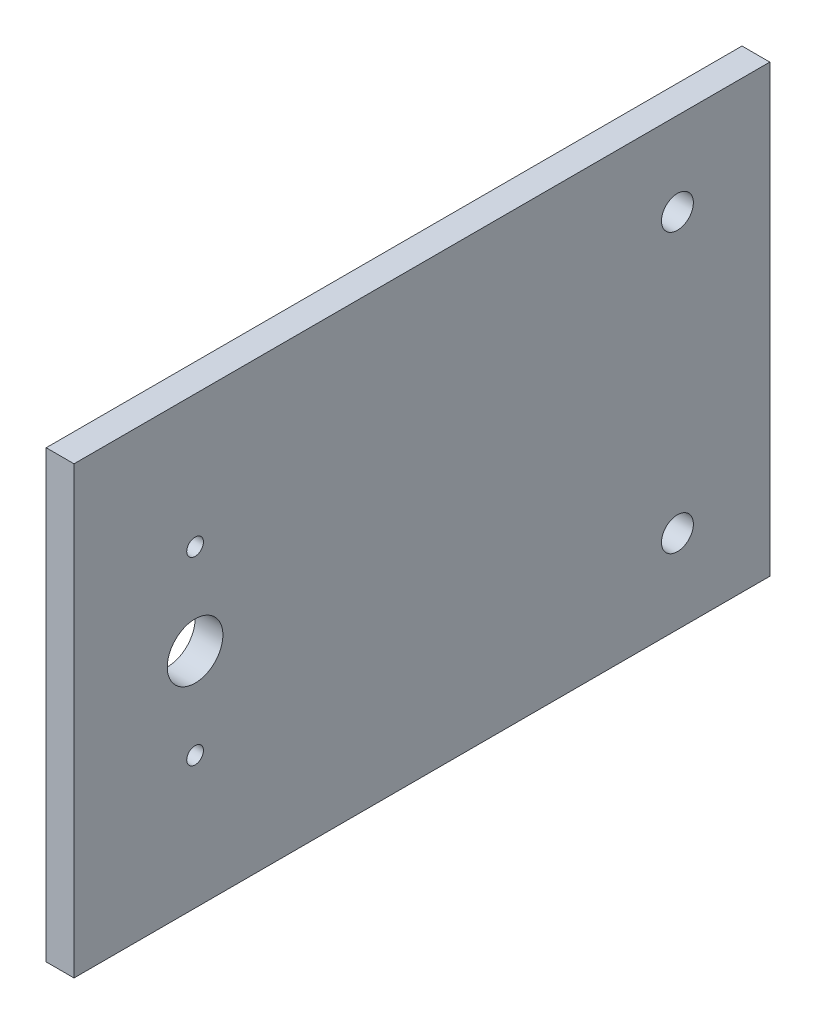
ISO-10303-21;
HEADER;
FILE_DESCRIPTION(('STEP AP214'),'2;1');
FILE_NAME('part.step','',(''),(''),'','','');
FILE_SCHEMA(('AUTOMOTIVE_DESIGN { 1 0 10303 214 1 1 1 1 }'));
ENDSEC;
DATA;
#1=APPLICATION_CONTEXT('core data for automotive mechanical design processes');
#2=APPLICATION_PROTOCOL_DEFINITION('international standard','automotive_design',2000,#1);
#3=PRODUCT_CONTEXT('',#1,'mechanical');
#4=PRODUCT('Part','Part','',(#3));
#5=PRODUCT_RELATED_PRODUCT_CATEGORY('part','',(#4));
#6=PRODUCT_DEFINITION_FORMATION('','',#4);
#7=PRODUCT_DEFINITION_CONTEXT('part definition',#1,'design');
#8=PRODUCT_DEFINITION('design','',#6,#7);
#9=PRODUCT_DEFINITION_SHAPE('','',#8);
#10=(LENGTH_UNIT() NAMED_UNIT(*) SI_UNIT(.MILLI.,.METRE.));
#11=(NAMED_UNIT(*) PLANE_ANGLE_UNIT() SI_UNIT($,.RADIAN.));
#12=(NAMED_UNIT(*) SI_UNIT($,.STERADIAN.) SOLID_ANGLE_UNIT());
#13=UNCERTAINTY_MEASURE_WITH_UNIT(LENGTH_MEASURE(1.E-05),#10,'distance_accuracy_value','');
#14=(GEOMETRIC_REPRESENTATION_CONTEXT(3) GLOBAL_UNCERTAINTY_ASSIGNED_CONTEXT((#13)) GLOBAL_UNIT_ASSIGNED_CONTEXT((#10,
#11,#12)) REPRESENTATION_CONTEXT('',''));
#15=CARTESIAN_POINT('',(0.,0.,0.));
#16=DIRECTION('',(0.,0.,1.));
#17=DIRECTION('',(1.,0.,0.));
#18=AXIS2_PLACEMENT_3D('',#15,#16,#17);
#19=CARTESIAN_POINT('',(5.,0.,0.));
#20=DIRECTION('',(-1.,0.,0.));
#21=DIRECTION('',(0.,0.,1.));
#22=AXIS2_PLACEMENT_3D('',#19,#20,#21);
#23=PLANE('',#22);
#24=DIRECTION('',(0.,0.,1.));
#25=VECTOR('',#24,1.);
#26=CARTESIAN_POINT('',(5.,40.,-62.5));
#27=LINE('',#26,#25);
#28=CARTESIAN_POINT('',(5.,40.,-62.5));
#29=VERTEX_POINT('',#28);
#30=CARTESIAN_POINT('',(5.,40.,62.5));
#31=VERTEX_POINT('',#30);
#32=EDGE_CURVE('E98',#29,#31,#27,.T.);
#33=ORIENTED_EDGE('',*,*,#32,.T.);
#34=DIRECTION('',(0.,-1.,0.));
#35=VECTOR('',#34,1.);
#36=CARTESIAN_POINT('',(5.,-40.,62.5));
#37=LINE('',#36,#35);
#38=CARTESIAN_POINT('',(5.,-40.,62.5));
#39=VERTEX_POINT('',#38);
#40=EDGE_CURVE('E93',#31,#39,#37,.T.);
#41=ORIENTED_EDGE('',*,*,#40,.T.);
#42=DIRECTION('',(0.,0.,-1.));
#43=VECTOR('',#42,1.);
#44=CARTESIAN_POINT('',(5.,-40.,-62.5));
#45=LINE('',#44,#43);
#46=CARTESIAN_POINT('',(5.,-40.,-62.5));
#47=VERTEX_POINT('',#46);
#48=EDGE_CURVE('E96',#39,#47,#45,.T.);
#49=ORIENTED_EDGE('',*,*,#48,.T.);
#50=DIRECTION('',(0.,1.,0.));
#51=VECTOR('',#50,1.);
#52=CARTESIAN_POINT('',(5.,-40.,-62.5));
#53=LINE('',#52,#51);
#54=EDGE_CURVE('E63',#47,#29,#53,.T.);
#55=ORIENTED_EDGE('',*,*,#54,.T.);
#56=EDGE_LOOP('',(#33,#41,#49,#55));
#57=FACE_BOUND('',#56,.T.);
#58=CARTESIAN_POINT('',(5.,-16.22,40.75));
#59=DIRECTION('',(1.,0.,0.));
#60=DIRECTION('',(0.,0.,-1.));
#61=AXIS2_PLACEMENT_3D('',#58,#59,#60);
#62=CIRCLE('',#61,1.5);
#63=CARTESIAN_POINT('',(5.,-16.22,39.25));
#64=VERTEX_POINT('',#63);
#65=EDGE_CURVE('E118',#64,#64,#62,.T.);
#66=ORIENTED_EDGE('',*,*,#65,.F.);
#67=EDGE_LOOP('',(#66));
#68=FACE_BOUND('',#67,.T.);
#69=CARTESIAN_POINT('',(5.,16.22,40.75));
#70=DIRECTION('',(1.,0.,0.));
#71=DIRECTION('',(0.,0.,1.));
#72=AXIS2_PLACEMENT_3D('',#69,#70,#71);
#73=CIRCLE('',#72,1.5);
#74=CARTESIAN_POINT('',(5.,16.22,42.25));
#75=VERTEX_POINT('',#74);
#76=EDGE_CURVE('E140',#75,#75,#73,.T.);
#77=ORIENTED_EDGE('',*,*,#76,.F.);
#78=EDGE_LOOP('',(#77));
#79=FACE_BOUND('',#78,.T.);
#80=CARTESIAN_POINT('',(5.,-25.,-45.9));
#81=DIRECTION('',(1.,0.,0.));
#82=DIRECTION('',(0.,0.,-1.));
#83=AXIS2_PLACEMENT_3D('',#80,#81,#82);
#84=CIRCLE('',#83,2.8668225219106);
#85=CARTESIAN_POINT('',(5.,-25.,-48.7668225219106));
#86=VERTEX_POINT('',#85);
#87=EDGE_CURVE('E148',#86,#86,#84,.T.);
#88=ORIENTED_EDGE('',*,*,#87,.F.);
#89=EDGE_LOOP('',(#88));
#90=FACE_BOUND('',#89,.T.);
#91=CARTESIAN_POINT('',(5.,0.,40.75));
#92=DIRECTION('',(1.,0.,0.));
#93=DIRECTION('',(0.,0.,-1.));
#94=AXIS2_PLACEMENT_3D('',#91,#92,#93);
#95=CIRCLE('',#94,5.);
#96=CARTESIAN_POINT('',(5.,0.,35.75));
#97=VERTEX_POINT('',#96);
#98=EDGE_CURVE('E156',#97,#97,#95,.T.);
#99=ORIENTED_EDGE('',*,*,#98,.F.);
#100=EDGE_LOOP('',(#99));
#101=FACE_BOUND('',#100,.T.);
#102=CARTESIAN_POINT('',(5.,25.,-45.9));
#103=DIRECTION('',(1.,0.,0.));
#104=DIRECTION('',(0.,0.,1.));
#105=AXIS2_PLACEMENT_3D('',#102,#103,#104);
#106=CIRCLE('',#105,2.8668225219106);
#107=CARTESIAN_POINT('',(5.,25.,-43.0331774780894));
#108=VERTEX_POINT('',#107);
#109=EDGE_CURVE('E164',#108,#108,#106,.T.);
#110=ORIENTED_EDGE('',*,*,#109,.F.);
#111=EDGE_LOOP('',(#110));
#112=FACE_BOUND('',#111,.T.);
#113=ADVANCED_FACE('F45',(#57,#68,#79,#90,#101,#112),#23,.F.);
#114=CARTESIAN_POINT('',(0.,0.,0.));
#115=DIRECTION('',(-1.,0.,0.));
#116=DIRECTION('',(0.,0.,1.));
#117=AXIS2_PLACEMENT_3D('',#114,#115,#116);
#118=PLANE('',#117);
#119=CARTESIAN_POINT('',(0.,0.,40.75));
#120=DIRECTION('',(1.,0.,0.));
#121=DIRECTION('',(0.,0.,-1.));
#122=AXIS2_PLACEMENT_3D('',#119,#120,#121);
#123=CIRCLE('',#122,5.);
#124=CARTESIAN_POINT('',(0.,0.,35.75));
#125=VERTEX_POINT('',#124);
#126=EDGE_CURVE('E160',#125,#125,#123,.T.);
#127=ORIENTED_EDGE('',*,*,#126,.T.);
#128=EDGE_LOOP('',(#127));
#129=FACE_BOUND('',#128,.T.);
#130=CARTESIAN_POINT('',(0.,16.22,40.75));
#131=DIRECTION('',(1.,0.,0.));
#132=DIRECTION('',(0.,0.,1.));
#133=AXIS2_PLACEMENT_3D('',#130,#131,#132);
#134=CIRCLE('',#133,1.5);
#135=CARTESIAN_POINT('',(0.,16.22,42.25));
#136=VERTEX_POINT('',#135);
#137=EDGE_CURVE('E144',#136,#136,#134,.T.);
#138=ORIENTED_EDGE('',*,*,#137,.T.);
#139=EDGE_LOOP('',(#138));
#140=FACE_BOUND('',#139,.T.);
#141=DIRECTION('',(0.,0.,1.));
#142=VECTOR('',#141,1.);
#143=CARTESIAN_POINT('',(0.,40.,-62.5));
#144=LINE('',#143,#142);
#145=CARTESIAN_POINT('',(0.,40.,-62.5));
#146=VERTEX_POINT('',#145);
#147=CARTESIAN_POINT('',(0.,40.,62.5));
#148=VERTEX_POINT('',#147);
#149=EDGE_CURVE('E114',#146,#148,#144,.T.);
#150=ORIENTED_EDGE('',*,*,#149,.F.);
#151=DIRECTION('',(0.,1.,0.));
#152=VECTOR('',#151,1.);
#153=CARTESIAN_POINT('',(0.,-40.,-62.5));
#154=LINE('',#153,#152);
#155=CARTESIAN_POINT('',(0.,-40.,-62.5));
#156=VERTEX_POINT('',#155);
#157=EDGE_CURVE('E86',#156,#146,#154,.T.);
#158=ORIENTED_EDGE('',*,*,#157,.F.);
#159=DIRECTION('',(0.,0.,-1.));
#160=VECTOR('',#159,1.);
#161=CARTESIAN_POINT('',(0.,-40.,-62.5));
#162=LINE('',#161,#160);
#163=CARTESIAN_POINT('',(0.,-40.,62.5));
#164=VERTEX_POINT('',#163);
#165=EDGE_CURVE('E80',#164,#156,#162,.T.);
#166=ORIENTED_EDGE('',*,*,#165,.F.);
#167=DIRECTION('',(0.,-1.,0.));
#168=VECTOR('',#167,1.);
#169=CARTESIAN_POINT('',(0.,-40.,62.5));
#170=LINE('',#169,#168);
#171=EDGE_CURVE('E103',#148,#164,#170,.T.);
#172=ORIENTED_EDGE('',*,*,#171,.F.);
#173=EDGE_LOOP('',(#150,#158,#166,#172));
#174=FACE_BOUND('',#173,.T.);
#175=CARTESIAN_POINT('',(0.,-16.22,40.75));
#176=DIRECTION('',(1.,0.,0.));
#177=DIRECTION('',(0.,0.,-1.));
#178=AXIS2_PLACEMENT_3D('',#175,#176,#177);
#179=CIRCLE('',#178,1.5);
#180=CARTESIAN_POINT('',(0.,-16.22,39.25));
#181=VERTEX_POINT('',#180);
#182=EDGE_CURVE('E136',#181,#181,#179,.T.);
#183=ORIENTED_EDGE('',*,*,#182,.T.);
#184=EDGE_LOOP('',(#183));
#185=FACE_BOUND('',#184,.T.);
#186=CARTESIAN_POINT('',(0.,-25.,-45.9));
#187=DIRECTION('',(1.,0.,0.));
#188=DIRECTION('',(0.,0.,-1.));
#189=AXIS2_PLACEMENT_3D('',#186,#187,#188);
#190=CIRCLE('',#189,2.8668225219106);
#191=CARTESIAN_POINT('',(0.,-25.,-48.7668225219106));
#192=VERTEX_POINT('',#191);
#193=EDGE_CURVE('E152',#192,#192,#190,.T.);
#194=ORIENTED_EDGE('',*,*,#193,.T.);
#195=EDGE_LOOP('',(#194));
#196=FACE_BOUND('',#195,.T.);
#197=CARTESIAN_POINT('',(0.,25.,-45.9));
#198=DIRECTION('',(1.,0.,0.));
#199=DIRECTION('',(0.,0.,1.));
#200=AXIS2_PLACEMENT_3D('',#197,#198,#199);
#201=CIRCLE('',#200,2.8668225219106);
#202=CARTESIAN_POINT('',(0.,25.,-43.0331774780894));
#203=VERTEX_POINT('',#202);
#204=EDGE_CURVE('E168',#203,#203,#201,.T.);
#205=ORIENTED_EDGE('',*,*,#204,.T.);
#206=EDGE_LOOP('',(#205));
#207=FACE_BOUND('',#206,.T.);
#208=ADVANCED_FACE('F131',(#129,#140,#174,#185,#196,#207),#118,.T.);
#209=CARTESIAN_POINT('',(5.,40.,-62.5));
#210=DIRECTION('',(0.,-1.,0.));
#211=DIRECTION('',(0.,0.,-1.));
#212=AXIS2_PLACEMENT_3D('',#209,#210,#211);
#213=PLANE('',#212);
#214=ORIENTED_EDGE('',*,*,#149,.T.);
#215=DIRECTION('',(-1.,0.,0.));
#216=VECTOR('',#215,1.);
#217=CARTESIAN_POINT('',(5.,40.,62.5));
#218=LINE('',#217,#216);
#219=EDGE_CURVE('E11',#31,#148,#218,.T.);
#220=ORIENTED_EDGE('',*,*,#219,.F.);
#221=ORIENTED_EDGE('',*,*,#32,.F.);
#222=DIRECTION('',(-1.,0.,0.));
#223=VECTOR('',#222,1.);
#224=CARTESIAN_POINT('',(5.,40.,-62.5));
#225=LINE('',#224,#223);
#226=EDGE_CURVE('E110',#29,#146,#225,.T.);
#227=ORIENTED_EDGE('',*,*,#226,.T.);
#228=EDGE_LOOP('',(#214,#220,#221,#227));
#229=FACE_BOUND('',#228,.T.);
#230=ADVANCED_FACE('F47',(#229),#213,.F.);
#231=CARTESIAN_POINT('',(5.,-40.,62.5));
#232=DIRECTION('',(0.,0.,-1.));
#233=DIRECTION('',(0.,1.,0.));
#234=AXIS2_PLACEMENT_3D('',#231,#232,#233);
#235=PLANE('',#234);
#236=ORIENTED_EDGE('',*,*,#171,.T.);
#237=DIRECTION('',(-1.,0.,0.));
#238=VECTOR('',#237,1.);
#239=CARTESIAN_POINT('',(5.,-40.,62.5));
#240=LINE('',#239,#238);
#241=EDGE_CURVE('E55',#39,#164,#240,.T.);
#242=ORIENTED_EDGE('',*,*,#241,.F.);
#243=ORIENTED_EDGE('',*,*,#40,.F.);
#244=ORIENTED_EDGE('',*,*,#219,.T.);
#245=EDGE_LOOP('',(#236,#242,#243,#244));
#246=FACE_BOUND('',#245,.T.);
#247=ADVANCED_FACE('F102',(#246),#235,.F.);
#248=CARTESIAN_POINT('',(5.,-40.,-62.5));
#249=DIRECTION('',(0.,1.,0.));
#250=DIRECTION('',(0.,0.,1.));
#251=AXIS2_PLACEMENT_3D('',#248,#249,#250);
#252=PLANE('',#251);
#253=ORIENTED_EDGE('',*,*,#165,.T.);
#254=DIRECTION('',(-1.,0.,0.));
#255=VECTOR('',#254,1.);
#256=CARTESIAN_POINT('',(5.,-40.,-62.5));
#257=LINE('',#256,#255);
#258=EDGE_CURVE('E105',#47,#156,#257,.T.);
#259=ORIENTED_EDGE('',*,*,#258,.F.);
#260=ORIENTED_EDGE('',*,*,#48,.F.);
#261=ORIENTED_EDGE('',*,*,#241,.T.);
#262=EDGE_LOOP('',(#253,#259,#260,#261));
#263=FACE_BOUND('',#262,.T.);
#264=ADVANCED_FACE('F106',(#263),#252,.F.);
#265=CARTESIAN_POINT('',(5.,-40.,-62.5));
#266=DIRECTION('',(0.,0.,1.));
#267=DIRECTION('',(0.,-1.,0.));
#268=AXIS2_PLACEMENT_3D('',#265,#266,#267);
#269=PLANE('',#268);
#270=ORIENTED_EDGE('',*,*,#157,.T.);
#271=ORIENTED_EDGE('',*,*,#226,.F.);
#272=ORIENTED_EDGE('',*,*,#54,.F.);
#273=ORIENTED_EDGE('',*,*,#258,.T.);
#274=EDGE_LOOP('',(#270,#271,#272,#273));
#275=FACE_BOUND('',#274,.T.);
#276=ADVANCED_FACE('F128',(#275),#269,.F.);
#277=CARTESIAN_POINT('',(5.,-16.22,40.75));
#278=DIRECTION('',(-1.,0.,0.));
#279=DIRECTION('',(0.,0.,1.));
#280=AXIS2_PLACEMENT_3D('',#277,#278,#279);
#281=CYLINDRICAL_SURFACE('',#280,1.5);
#282=ORIENTED_EDGE('',*,*,#65,.T.);
#283=EDGE_LOOP('',(#282));
#284=FACE_BOUND('',#283,.T.);
#285=ORIENTED_EDGE('',*,*,#182,.F.);
#286=EDGE_LOOP('',(#285));
#287=FACE_BOUND('',#286,.T.);
#288=ADVANCED_FACE('F187',(#284,#287),#281,.F.);
#289=CARTESIAN_POINT('',(5.,16.22,40.75));
#290=DIRECTION('',(-1.,0.,0.));
#291=DIRECTION('',(0.,0.,1.));
#292=AXIS2_PLACEMENT_3D('',#289,#290,#291);
#293=CYLINDRICAL_SURFACE('',#292,1.5);
#294=ORIENTED_EDGE('',*,*,#76,.T.);
#295=EDGE_LOOP('',(#294));
#296=FACE_BOUND('',#295,.T.);
#297=ORIENTED_EDGE('',*,*,#137,.F.);
#298=EDGE_LOOP('',(#297));
#299=FACE_BOUND('',#298,.T.);
#300=ADVANCED_FACE('F232',(#296,#299),#293,.F.);
#301=CARTESIAN_POINT('',(5.,-25.,-45.9));
#302=DIRECTION('',(-1.,0.,0.));
#303=DIRECTION('',(0.,0.,1.));
#304=AXIS2_PLACEMENT_3D('',#301,#302,#303);
#305=CYLINDRICAL_SURFACE('',#304,2.8668225219106);
#306=ORIENTED_EDGE('',*,*,#87,.T.);
#307=EDGE_LOOP('',(#306));
#308=FACE_BOUND('',#307,.T.);
#309=ORIENTED_EDGE('',*,*,#193,.F.);
#310=EDGE_LOOP('',(#309));
#311=FACE_BOUND('',#310,.T.);
#312=ADVANCED_FACE('F240',(#308,#311),#305,.F.);
#313=CARTESIAN_POINT('',(5.,0.,40.75));
#314=DIRECTION('',(-1.,0.,0.));
#315=DIRECTION('',(0.,0.,1.));
#316=AXIS2_PLACEMENT_3D('',#313,#314,#315);
#317=CYLINDRICAL_SURFACE('',#316,5.);
#318=ORIENTED_EDGE('',*,*,#98,.T.);
#319=EDGE_LOOP('',(#318));
#320=FACE_BOUND('',#319,.T.);
#321=ORIENTED_EDGE('',*,*,#126,.F.);
#322=EDGE_LOOP('',(#321));
#323=FACE_BOUND('',#322,.T.);
#324=ADVANCED_FACE('F248',(#320,#323),#317,.F.);
#325=CARTESIAN_POINT('',(5.,25.,-45.9));
#326=DIRECTION('',(-1.,0.,0.));
#327=DIRECTION('',(0.,0.,1.));
#328=AXIS2_PLACEMENT_3D('',#325,#326,#327);
#329=CYLINDRICAL_SURFACE('',#328,2.8668225219106);
#330=ORIENTED_EDGE('',*,*,#109,.T.);
#331=EDGE_LOOP('',(#330));
#332=FACE_BOUND('',#331,.T.);
#333=ORIENTED_EDGE('',*,*,#204,.F.);
#334=EDGE_LOOP('',(#333));
#335=FACE_BOUND('',#334,.T.);
#336=ADVANCED_FACE('F176',(#332,#335),#329,.F.);
#337=CLOSED_SHELL('',(#113,#208,#230,#247,#264,#276,#288,#300,#312,#324,#336));
#338=MANIFOLD_SOLID_BREP('B2',#337);
#339=ADVANCED_BREP_SHAPE_REPRESENTATION('',(#18,#338),#14);
#340=SHAPE_DEFINITION_REPRESENTATION(#9,#339);
ENDSEC;
END-ISO-10303-21;
